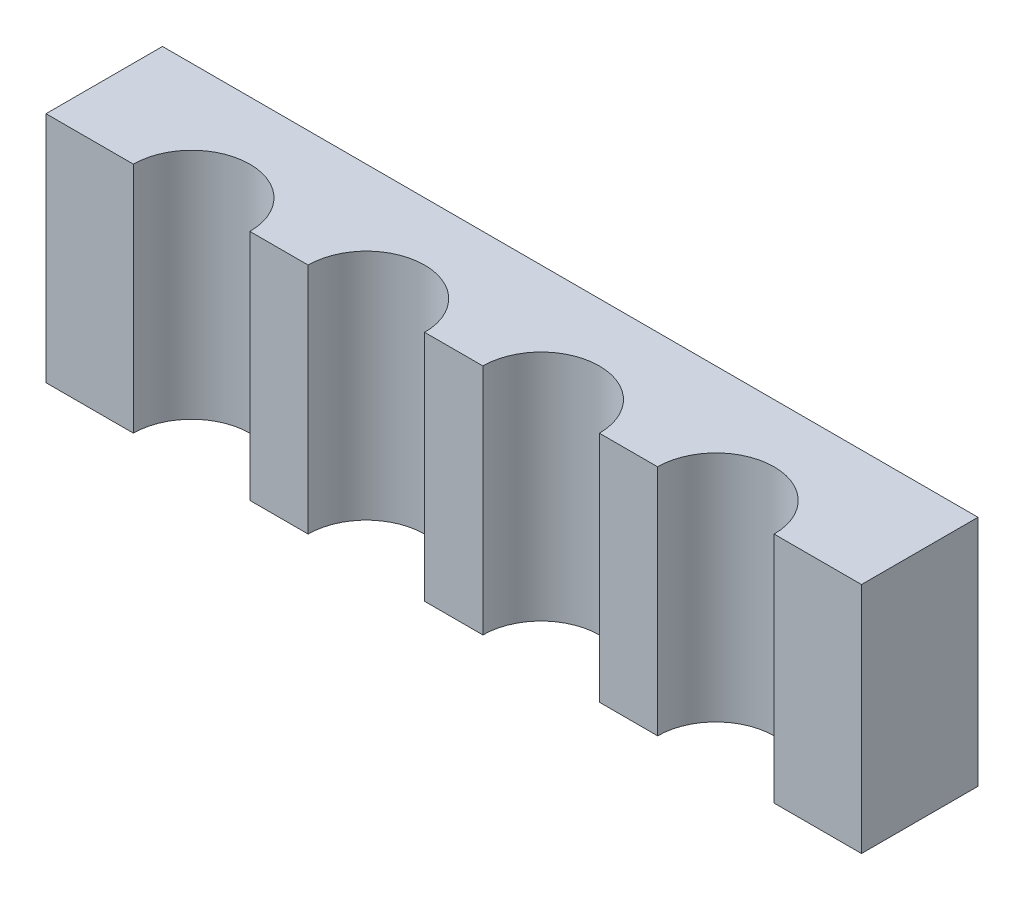
ISO-10303-21;
HEADER;
FILE_DESCRIPTION(('STEP AP214'),'2;1');
FILE_NAME('part.step','',(''),(''),'','','');
FILE_SCHEMA(('AUTOMOTIVE_DESIGN { 1 0 10303 214 1 1 1 1 }'));
ENDSEC;
DATA;
#1=APPLICATION_CONTEXT('core data for automotive mechanical design processes');
#2=APPLICATION_PROTOCOL_DEFINITION('international standard','automotive_design',2000,#1);
#3=PRODUCT_CONTEXT('',#1,'mechanical');
#4=PRODUCT('Part','Part','',(#3));
#5=PRODUCT_RELATED_PRODUCT_CATEGORY('part','',(#4));
#6=PRODUCT_DEFINITION_FORMATION('','',#4);
#7=PRODUCT_DEFINITION_CONTEXT('part definition',#1,'design');
#8=PRODUCT_DEFINITION('design','',#6,#7);
#9=PRODUCT_DEFINITION_SHAPE('','',#8);
#10=(LENGTH_UNIT() NAMED_UNIT(*) SI_UNIT(.MILLI.,.METRE.));
#11=(NAMED_UNIT(*) PLANE_ANGLE_UNIT() SI_UNIT($,.RADIAN.));
#12=(NAMED_UNIT(*) SI_UNIT($,.STERADIAN.) SOLID_ANGLE_UNIT());
#13=UNCERTAINTY_MEASURE_WITH_UNIT(LENGTH_MEASURE(1.E-05),#10,'distance_accuracy_value','');
#14=(GEOMETRIC_REPRESENTATION_CONTEXT(3) GLOBAL_UNCERTAINTY_ASSIGNED_CONTEXT((#13)) GLOBAL_UNIT_ASSIGNED_CONTEXT((#10,
#11,#12)) REPRESENTATION_CONTEXT('',''));
#15=CARTESIAN_POINT('',(0.,0.,0.));
#16=DIRECTION('',(0.,0.,1.));
#17=DIRECTION('',(1.,0.,0.));
#18=AXIS2_PLACEMENT_3D('',#15,#16,#17);
#19=CARTESIAN_POINT('',(165.,120.,30.));
#20=DIRECTION('',(0.,0.,-1.));
#21=DIRECTION('',(-1.,0.,0.));
#22=AXIS2_PLACEMENT_3D('',#19,#20,#21);
#23=PLANE('',#22);
#24=DIRECTION('',(1.,0.,0.));
#25=VECTOR('',#24,1.);
#26=CARTESIAN_POINT('',(165.,0.,30.));
#27=LINE('',#26,#25);
#28=CARTESIAN_POINT('',(165.,0.,30.));
#29=VERTEX_POINT('',#28);
#30=CARTESIAN_POINT('',(210.,0.,30.));
#31=VERTEX_POINT('',#30);
#32=EDGE_CURVE('E164',#29,#31,#27,.T.);
#33=ORIENTED_EDGE('',*,*,#32,.T.);
#34=DIRECTION('',(0.,-1.,0.));
#35=VECTOR('',#34,1.);
#36=CARTESIAN_POINT('',(210.,120.,30.));
#37=LINE('',#36,#35);
#38=CARTESIAN_POINT('',(210.,120.,30.));
#39=VERTEX_POINT('',#38);
#40=EDGE_CURVE('E11',#39,#31,#37,.T.);
#41=ORIENTED_EDGE('',*,*,#40,.F.);
#42=DIRECTION('',(1.,0.,0.));
#43=VECTOR('',#42,1.);
#44=CARTESIAN_POINT('',(165.,120.,30.));
#45=LINE('',#44,#43);
#46=CARTESIAN_POINT('',(165.,120.,30.));
#47=VERTEX_POINT('',#46);
#48=EDGE_CURVE('E198',#47,#39,#45,.T.);
#49=ORIENTED_EDGE('',*,*,#48,.F.);
#50=DIRECTION('',(0.,-1.,0.));
#51=VECTOR('',#50,1.);
#52=CARTESIAN_POINT('',(165.,120.,30.));
#53=LINE('',#52,#51);
#54=EDGE_CURVE('E160',#47,#29,#53,.T.);
#55=ORIENTED_EDGE('',*,*,#54,.T.);
#56=EDGE_LOOP('',(#33,#41,#49,#55));
#57=FACE_BOUND('',#56,.T.);
#58=ADVANCED_FACE('F39',(#57),#23,.F.);
#59=CARTESIAN_POINT('',(210.,120.,-30.));
#60=DIRECTION('',(-1.,0.,0.));
#61=DIRECTION('',(0.,0.,1.));
#62=AXIS2_PLACEMENT_3D('',#59,#60,#61);
#63=PLANE('',#62);
#64=DIRECTION('',(0.,0.,-1.));
#65=VECTOR('',#64,1.);
#66=CARTESIAN_POINT('',(210.,0.,-30.));
#67=LINE('',#66,#65);
#68=CARTESIAN_POINT('',(210.,0.,-30.));
#69=VERTEX_POINT('',#68);
#70=EDGE_CURVE('E168',#31,#69,#67,.T.);
#71=ORIENTED_EDGE('',*,*,#70,.T.);
#72=DIRECTION('',(0.,-1.,0.));
#73=VECTOR('',#72,1.);
#74=CARTESIAN_POINT('',(210.,120.,-30.));
#75=LINE('',#74,#73);
#76=CARTESIAN_POINT('',(210.,120.,-30.));
#77=VERTEX_POINT('',#76);
#78=EDGE_CURVE('E48',#77,#69,#75,.T.);
#79=ORIENTED_EDGE('',*,*,#78,.F.);
#80=DIRECTION('',(0.,0.,-1.));
#81=VECTOR('',#80,1.);
#82=CARTESIAN_POINT('',(210.,120.,-30.));
#83=LINE('',#82,#81);
#84=EDGE_CURVE('E111',#39,#77,#83,.T.);
#85=ORIENTED_EDGE('',*,*,#84,.F.);
#86=ORIENTED_EDGE('',*,*,#40,.T.);
#87=EDGE_LOOP('',(#71,#79,#85,#86));
#88=FACE_BOUND('',#87,.T.);
#89=ADVANCED_FACE('F292',(#88),#63,.F.);
#90=CARTESIAN_POINT('',(-210.,120.,-30.));
#91=DIRECTION('',(0.,0.,1.));
#92=DIRECTION('',(1.,0.,0.));
#93=AXIS2_PLACEMENT_3D('',#90,#91,#92);
#94=PLANE('',#93);
#95=DIRECTION('',(-1.,0.,0.));
#96=VECTOR('',#95,1.);
#97=CARTESIAN_POINT('',(-210.,0.,-30.));
#98=LINE('',#97,#96);
#99=CARTESIAN_POINT('',(-210.,0.,-30.));
#100=VERTEX_POINT('',#99);
#101=EDGE_CURVE('E171',#69,#100,#98,.T.);
#102=ORIENTED_EDGE('',*,*,#101,.T.);
#103=DIRECTION('',(0.,-1.,0.));
#104=VECTOR('',#103,1.);
#105=CARTESIAN_POINT('',(-210.,120.,-30.));
#106=LINE('',#105,#104);
#107=CARTESIAN_POINT('',(-210.,120.,-30.));
#108=VERTEX_POINT('',#107);
#109=EDGE_CURVE('E225',#108,#100,#106,.T.);
#110=ORIENTED_EDGE('',*,*,#109,.F.);
#111=DIRECTION('',(-1.,0.,0.));
#112=VECTOR('',#111,1.);
#113=CARTESIAN_POINT('',(-210.,120.,-30.));
#114=LINE('',#113,#112);
#115=EDGE_CURVE('E235',#77,#108,#114,.T.);
#116=ORIENTED_EDGE('',*,*,#115,.F.);
#117=ORIENTED_EDGE('',*,*,#78,.T.);
#118=EDGE_LOOP('',(#102,#110,#116,#117));
#119=FACE_BOUND('',#118,.T.);
#120=ADVANCED_FACE('F233',(#119),#94,.F.);
#121=CARTESIAN_POINT('',(-210.,120.,-30.));
#122=DIRECTION('',(1.,0.,0.));
#123=DIRECTION('',(0.,0.,-1.));
#124=AXIS2_PLACEMENT_3D('',#121,#122,#123);
#125=PLANE('',#124);
#126=DIRECTION('',(0.,0.,1.));
#127=VECTOR('',#126,1.);
#128=CARTESIAN_POINT('',(-210.,0.,-30.));
#129=LINE('',#128,#127);
#130=CARTESIAN_POINT('',(-210.,0.,30.));
#131=VERTEX_POINT('',#130);
#132=EDGE_CURVE('E174',#100,#131,#129,.T.);
#133=ORIENTED_EDGE('',*,*,#132,.T.);
#134=DIRECTION('',(0.,-1.,0.));
#135=VECTOR('',#134,1.);
#136=CARTESIAN_POINT('',(-210.,120.,30.));
#137=LINE('',#136,#135);
#138=CARTESIAN_POINT('',(-210.,120.,30.));
#139=VERTEX_POINT('',#138);
#140=EDGE_CURVE('E221',#139,#131,#137,.T.);
#141=ORIENTED_EDGE('',*,*,#140,.F.);
#142=DIRECTION('',(0.,0.,1.));
#143=VECTOR('',#142,1.);
#144=CARTESIAN_POINT('',(-210.,120.,-30.));
#145=LINE('',#144,#143);
#146=EDGE_CURVE('E254',#108,#139,#145,.T.);
#147=ORIENTED_EDGE('',*,*,#146,.F.);
#148=ORIENTED_EDGE('',*,*,#109,.T.);
#149=EDGE_LOOP('',(#133,#141,#147,#148));
#150=FACE_BOUND('',#149,.T.);
#151=ADVANCED_FACE('F244',(#150),#125,.F.);
#152=CARTESIAN_POINT('',(-210.,120.,30.));
#153=DIRECTION('',(0.,0.,-1.));
#154=DIRECTION('',(-1.,0.,0.));
#155=AXIS2_PLACEMENT_3D('',#152,#153,#154);
#156=PLANE('',#155);
#157=DIRECTION('',(1.,0.,0.));
#158=VECTOR('',#157,1.);
#159=CARTESIAN_POINT('',(-210.,0.,30.));
#160=LINE('',#159,#158);
#161=CARTESIAN_POINT('',(-165.,0.,30.));
#162=VERTEX_POINT('',#161);
#163=EDGE_CURVE('E177',#131,#162,#160,.T.);
#164=ORIENTED_EDGE('',*,*,#163,.T.);
#165=DIRECTION('',(0.,-1.,0.));
#166=VECTOR('',#165,1.);
#167=CARTESIAN_POINT('',(-165.,120.,30.));
#168=LINE('',#167,#166);
#169=CARTESIAN_POINT('',(-165.,120.,30.));
#170=VERTEX_POINT('',#169);
#171=EDGE_CURVE('E217',#170,#162,#168,.T.);
#172=ORIENTED_EDGE('',*,*,#171,.F.);
#173=DIRECTION('',(1.,0.,0.));
#174=VECTOR('',#173,1.);
#175=CARTESIAN_POINT('',(-210.,120.,30.));
#176=LINE('',#175,#174);
#177=EDGE_CURVE('E250',#139,#170,#176,.T.);
#178=ORIENTED_EDGE('',*,*,#177,.F.);
#179=ORIENTED_EDGE('',*,*,#140,.T.);
#180=EDGE_LOOP('',(#164,#172,#178,#179));
#181=FACE_BOUND('',#180,.T.);
#182=ADVANCED_FACE('F248',(#181),#156,.F.);
#183=CARTESIAN_POINT('',(-135.,120.,30.));
#184=DIRECTION('',(0.,-1.,0.));
#185=DIRECTION('',(0.,0.,-1.));
#186=AXIS2_PLACEMENT_3D('',#183,#184,#185);
#187=CYLINDRICAL_SURFACE('',#186,30.);
#188=CARTESIAN_POINT('',(-135.,0.,30.));
#189=DIRECTION('',(0.,-1.,0.));
#190=DIRECTION('',(0.,0.,1.));
#191=AXIS2_PLACEMENT_3D('',#188,#189,#190);
#192=CIRCLE('',#191,30.);
#193=CARTESIAN_POINT('',(-105.,0.,30.));
#194=VERTEX_POINT('',#193);
#195=EDGE_CURVE('E180',#162,#194,#192,.T.);
#196=ORIENTED_EDGE('',*,*,#195,.T.);
#197=DIRECTION('',(0.,-1.,0.));
#198=VECTOR('',#197,1.);
#199=CARTESIAN_POINT('',(-105.,120.,30.));
#200=LINE('',#199,#198);
#201=CARTESIAN_POINT('',(-105.,120.,30.));
#202=VERTEX_POINT('',#201);
#203=EDGE_CURVE('E213',#202,#194,#200,.T.);
#204=ORIENTED_EDGE('',*,*,#203,.F.);
#205=CARTESIAN_POINT('',(-135.,120.,30.));
#206=DIRECTION('',(0.,-1.,0.));
#207=DIRECTION('',(0.,0.,1.));
#208=AXIS2_PLACEMENT_3D('',#205,#206,#207);
#209=CIRCLE('',#208,30.);
#210=EDGE_CURVE('E253',#170,#202,#209,.T.);
#211=ORIENTED_EDGE('',*,*,#210,.F.);
#212=ORIENTED_EDGE('',*,*,#171,.T.);
#213=EDGE_LOOP('',(#196,#204,#211,#212));
#214=FACE_BOUND('',#213,.T.);
#215=ADVANCED_FACE('F305',(#214),#187,.F.);
#216=CARTESIAN_POINT('',(-105.,120.,30.));
#217=DIRECTION('',(0.,0.,-1.));
#218=DIRECTION('',(-1.,0.,0.));
#219=AXIS2_PLACEMENT_3D('',#216,#217,#218);
#220=PLANE('',#219);
#221=DIRECTION('',(1.,0.,0.));
#222=VECTOR('',#221,1.);
#223=CARTESIAN_POINT('',(-105.,0.,30.));
#224=LINE('',#223,#222);
#225=CARTESIAN_POINT('',(-75.,0.,30.));
#226=VERTEX_POINT('',#225);
#227=EDGE_CURVE('E183',#194,#226,#224,.T.);
#228=ORIENTED_EDGE('',*,*,#227,.T.);
#229=DIRECTION('',(0.,-1.,0.));
#230=VECTOR('',#229,1.);
#231=CARTESIAN_POINT('',(-75.,120.,30.));
#232=LINE('',#231,#230);
#233=CARTESIAN_POINT('',(-75.,120.,30.));
#234=VERTEX_POINT('',#233);
#235=EDGE_CURVE('E209',#234,#226,#232,.T.);
#236=ORIENTED_EDGE('',*,*,#235,.F.);
#237=DIRECTION('',(1.,0.,0.));
#238=VECTOR('',#237,1.);
#239=CARTESIAN_POINT('',(-105.,120.,30.));
#240=LINE('',#239,#238);
#241=EDGE_CURVE('E258',#202,#234,#240,.T.);
#242=ORIENTED_EDGE('',*,*,#241,.F.);
#243=ORIENTED_EDGE('',*,*,#203,.T.);
#244=EDGE_LOOP('',(#228,#236,#242,#243));
#245=FACE_BOUND('',#244,.T.);
#246=ADVANCED_FACE('F308',(#245),#220,.F.);
#247=CARTESIAN_POINT('',(-45.,120.,30.));
#248=DIRECTION('',(0.,-1.,0.));
#249=DIRECTION('',(0.,0.,-1.));
#250=AXIS2_PLACEMENT_3D('',#247,#248,#249);
#251=CYLINDRICAL_SURFACE('',#250,30.);
#252=CARTESIAN_POINT('',(-45.,0.,30.));
#253=DIRECTION('',(0.,-1.,0.));
#254=DIRECTION('',(0.,0.,1.));
#255=AXIS2_PLACEMENT_3D('',#252,#253,#254);
#256=CIRCLE('',#255,30.);
#257=CARTESIAN_POINT('',(-15.,0.,30.));
#258=VERTEX_POINT('',#257);
#259=EDGE_CURVE('E186',#226,#258,#256,.T.);
#260=ORIENTED_EDGE('',*,*,#259,.T.);
#261=DIRECTION('',(0.,-1.,0.));
#262=VECTOR('',#261,1.);
#263=CARTESIAN_POINT('',(-15.,120.,30.));
#264=LINE('',#263,#262);
#265=CARTESIAN_POINT('',(-15.,120.,30.));
#266=VERTEX_POINT('',#265);
#267=EDGE_CURVE('E205',#266,#258,#264,.T.);
#268=ORIENTED_EDGE('',*,*,#267,.F.);
#269=CARTESIAN_POINT('',(-45.,120.,30.));
#270=DIRECTION('',(0.,-1.,0.));
#271=DIRECTION('',(0.,0.,1.));
#272=AXIS2_PLACEMENT_3D('',#269,#270,#271);
#273=CIRCLE('',#272,30.);
#274=EDGE_CURVE('E265',#234,#266,#273,.T.);
#275=ORIENTED_EDGE('',*,*,#274,.F.);
#276=ORIENTED_EDGE('',*,*,#235,.T.);
#277=EDGE_LOOP('',(#260,#268,#275,#276));
#278=FACE_BOUND('',#277,.T.);
#279=ADVANCED_FACE('F273',(#278),#251,.F.);
#280=CARTESIAN_POINT('',(-15.,120.,30.));
#281=DIRECTION('',(0.,0.,-1.));
#282=DIRECTION('',(-1.,0.,0.));
#283=AXIS2_PLACEMENT_3D('',#280,#281,#282);
#284=PLANE('',#283);
#285=DIRECTION('',(1.,0.,0.));
#286=VECTOR('',#285,1.);
#287=CARTESIAN_POINT('',(-15.,0.,30.));
#288=LINE('',#287,#286);
#289=CARTESIAN_POINT('',(15.,0.,30.));
#290=VERTEX_POINT('',#289);
#291=EDGE_CURVE('E189',#258,#290,#288,.T.);
#292=ORIENTED_EDGE('',*,*,#291,.T.);
#293=DIRECTION('',(0.,-1.,0.));
#294=VECTOR('',#293,1.);
#295=CARTESIAN_POINT('',(15.,120.,30.));
#296=LINE('',#295,#294);
#297=CARTESIAN_POINT('',(15.,120.,30.));
#298=VERTEX_POINT('',#297);
#299=EDGE_CURVE('E153',#298,#290,#296,.T.);
#300=ORIENTED_EDGE('',*,*,#299,.F.);
#301=DIRECTION('',(1.,0.,0.));
#302=VECTOR('',#301,1.);
#303=CARTESIAN_POINT('',(-15.,120.,30.));
#304=LINE('',#303,#302);
#305=EDGE_CURVE('E142',#266,#298,#304,.T.);
#306=ORIENTED_EDGE('',*,*,#305,.F.);
#307=ORIENTED_EDGE('',*,*,#267,.T.);
#308=EDGE_LOOP('',(#292,#300,#306,#307));
#309=FACE_BOUND('',#308,.T.);
#310=ADVANCED_FACE('F277',(#309),#284,.F.);
#311=CARTESIAN_POINT('',(45.,120.,30.));
#312=DIRECTION('',(0.,-1.,0.));
#313=DIRECTION('',(0.,0.,-1.));
#314=AXIS2_PLACEMENT_3D('',#311,#312,#313);
#315=CYLINDRICAL_SURFACE('',#314,30.);
#316=CARTESIAN_POINT('',(45.,0.,30.));
#317=DIRECTION('',(0.,-1.,0.));
#318=DIRECTION('',(0.,0.,1.));
#319=AXIS2_PLACEMENT_3D('',#316,#317,#318);
#320=CIRCLE('',#319,30.);
#321=CARTESIAN_POINT('',(75.,0.,30.));
#322=VERTEX_POINT('',#321);
#323=EDGE_CURVE('E151',#290,#322,#320,.T.);
#324=ORIENTED_EDGE('',*,*,#323,.T.);
#325=DIRECTION('',(0.,-1.,0.));
#326=VECTOR('',#325,1.);
#327=CARTESIAN_POINT('',(75.,120.,30.));
#328=LINE('',#327,#326);
#329=CARTESIAN_POINT('',(75.,120.,30.));
#330=VERTEX_POINT('',#329);
#331=EDGE_CURVE('E148',#330,#322,#328,.T.);
#332=ORIENTED_EDGE('',*,*,#331,.F.);
#333=CARTESIAN_POINT('',(45.,120.,30.));
#334=DIRECTION('',(0.,-1.,0.));
#335=DIRECTION('',(0.,0.,1.));
#336=AXIS2_PLACEMENT_3D('',#333,#334,#335);
#337=CIRCLE('',#336,30.);
#338=EDGE_CURVE('E136',#298,#330,#337,.T.);
#339=ORIENTED_EDGE('',*,*,#338,.F.);
#340=ORIENTED_EDGE('',*,*,#299,.T.);
#341=EDGE_LOOP('',(#324,#332,#339,#340));
#342=FACE_BOUND('',#341,.T.);
#343=ADVANCED_FACE('F149',(#342),#315,.F.);
#344=CARTESIAN_POINT('',(75.,120.,30.));
#345=DIRECTION('',(0.,0.,-1.));
#346=DIRECTION('',(-1.,0.,0.));
#347=AXIS2_PLACEMENT_3D('',#344,#345,#346);
#348=PLANE('',#347);
#349=DIRECTION('',(1.,0.,0.));
#350=VECTOR('',#349,1.);
#351=CARTESIAN_POINT('',(75.,0.,30.));
#352=LINE('',#351,#350);
#353=CARTESIAN_POINT('',(105.,0.,30.));
#354=VERTEX_POINT('',#353);
#355=EDGE_CURVE('E97',#322,#354,#352,.T.);
#356=ORIENTED_EDGE('',*,*,#355,.T.);
#357=DIRECTION('',(0.,-1.,0.));
#358=VECTOR('',#357,1.);
#359=CARTESIAN_POINT('',(105.,120.,30.));
#360=LINE('',#359,#358);
#361=CARTESIAN_POINT('',(105.,120.,30.));
#362=VERTEX_POINT('',#361);
#363=EDGE_CURVE('E154',#362,#354,#360,.T.);
#364=ORIENTED_EDGE('',*,*,#363,.F.);
#365=DIRECTION('',(1.,0.,0.));
#366=VECTOR('',#365,1.);
#367=CARTESIAN_POINT('',(75.,120.,30.));
#368=LINE('',#367,#366);
#369=EDGE_CURVE('E140',#330,#362,#368,.T.);
#370=ORIENTED_EDGE('',*,*,#369,.F.);
#371=ORIENTED_EDGE('',*,*,#331,.T.);
#372=EDGE_LOOP('',(#356,#364,#370,#371));
#373=FACE_BOUND('',#372,.T.);
#374=ADVANCED_FACE('F156',(#373),#348,.F.);
#375=CARTESIAN_POINT('',(135.,120.,30.));
#376=DIRECTION('',(0.,-1.,0.));
#377=DIRECTION('',(0.,0.,-1.));
#378=AXIS2_PLACEMENT_3D('',#375,#376,#377);
#379=CYLINDRICAL_SURFACE('',#378,30.);
#380=CARTESIAN_POINT('',(135.,0.,30.));
#381=DIRECTION('',(0.,-1.,0.));
#382=DIRECTION('',(0.,0.,1.));
#383=AXIS2_PLACEMENT_3D('',#380,#381,#382);
#384=CIRCLE('',#383,30.);
#385=EDGE_CURVE('E103',#354,#29,#384,.T.);
#386=ORIENTED_EDGE('',*,*,#385,.T.);
#387=ORIENTED_EDGE('',*,*,#54,.F.);
#388=CARTESIAN_POINT('',(135.,120.,30.));
#389=DIRECTION('',(0.,-1.,0.));
#390=DIRECTION('',(0.,0.,1.));
#391=AXIS2_PLACEMENT_3D('',#388,#389,#390);
#392=CIRCLE('',#391,30.);
#393=EDGE_CURVE('E56',#362,#47,#392,.T.);
#394=ORIENTED_EDGE('',*,*,#393,.F.);
#395=ORIENTED_EDGE('',*,*,#363,.T.);
#396=EDGE_LOOP('',(#386,#387,#394,#395));
#397=FACE_BOUND('',#396,.T.);
#398=ADVANCED_FACE('F281',(#397),#379,.F.);
#399=CARTESIAN_POINT('',(-135.,120.,30.));
#400=DIRECTION('',(0.,1.,0.));
#401=DIRECTION('',(0.,0.,1.));
#402=AXIS2_PLACEMENT_3D('',#399,#400,#401);
#403=PLANE('',#402);
#404=ORIENTED_EDGE('',*,*,#48,.T.);
#405=ORIENTED_EDGE('',*,*,#84,.T.);
#406=ORIENTED_EDGE('',*,*,#115,.T.);
#407=ORIENTED_EDGE('',*,*,#146,.T.);
#408=ORIENTED_EDGE('',*,*,#177,.T.);
#409=ORIENTED_EDGE('',*,*,#210,.T.);
#410=ORIENTED_EDGE('',*,*,#241,.T.);
#411=ORIENTED_EDGE('',*,*,#274,.T.);
#412=ORIENTED_EDGE('',*,*,#305,.T.);
#413=ORIENTED_EDGE('',*,*,#338,.T.);
#414=ORIENTED_EDGE('',*,*,#369,.T.);
#415=ORIENTED_EDGE('',*,*,#393,.T.);
#416=EDGE_LOOP('',(#404,#405,#406,#407,#408,#409,#410,#411,#412,#413,#414,#415));
#417=FACE_BOUND('',#416,.T.);
#418=ADVANCED_FACE('F138',(#417),#403,.T.);
#419=CARTESIAN_POINT('',(-135.,0.,30.));
#420=DIRECTION('',(0.,1.,0.));
#421=DIRECTION('',(0.,0.,1.));
#422=AXIS2_PLACEMENT_3D('',#419,#420,#421);
#423=PLANE('',#422);
#424=ORIENTED_EDGE('',*,*,#32,.F.);
#425=ORIENTED_EDGE('',*,*,#385,.F.);
#426=ORIENTED_EDGE('',*,*,#355,.F.);
#427=ORIENTED_EDGE('',*,*,#323,.F.);
#428=ORIENTED_EDGE('',*,*,#291,.F.);
#429=ORIENTED_EDGE('',*,*,#259,.F.);
#430=ORIENTED_EDGE('',*,*,#227,.F.);
#431=ORIENTED_EDGE('',*,*,#195,.F.);
#432=ORIENTED_EDGE('',*,*,#163,.F.);
#433=ORIENTED_EDGE('',*,*,#132,.F.);
#434=ORIENTED_EDGE('',*,*,#101,.F.);
#435=ORIENTED_EDGE('',*,*,#70,.F.);
#436=EDGE_LOOP('',(#424,#425,#426,#427,#428,#429,#430,#431,#432,#433,#434,#435));
#437=FACE_BOUND('',#436,.T.);
#438=ADVANCED_FACE('F239',(#437),#423,.F.);
#439=CLOSED_SHELL('',(#58,#89,#120,#151,#182,#215,#246,#279,#310,#343,#374,#398,#418,#438));
#440=MANIFOLD_SOLID_BREP('B2',#439);
#441=ADVANCED_BREP_SHAPE_REPRESENTATION('',(#18,#440),#14);
#442=SHAPE_DEFINITION_REPRESENTATION(#9,#441);
ENDSEC;
END-ISO-10303-21;
